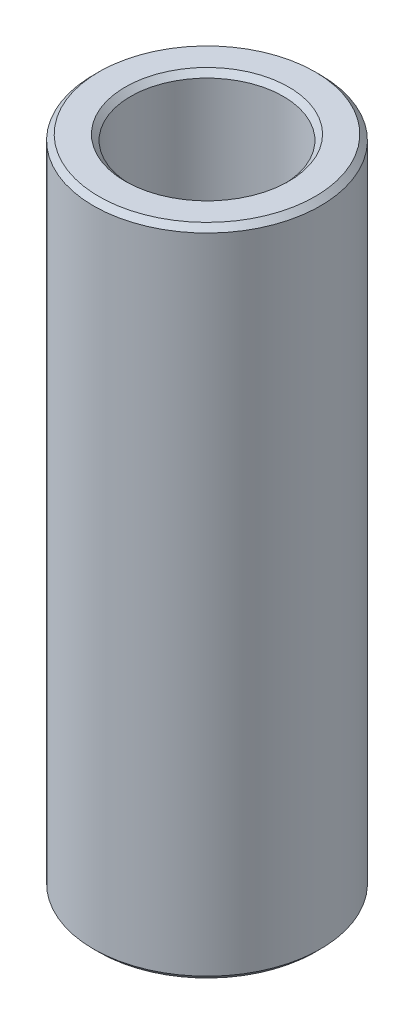
ISO-10303-21;
HEADER;
FILE_DESCRIPTION(('STEP AP214'),'2;1');
FILE_NAME('part.step','',(''),(''),'','','');
FILE_SCHEMA(('AUTOMOTIVE_DESIGN { 1 0 10303 214 1 1 1 1 }'));
ENDSEC;
DATA;
#1=APPLICATION_CONTEXT('core data for automotive mechanical design processes');
#2=APPLICATION_PROTOCOL_DEFINITION('international standard','automotive_design',2000,#1);
#3=PRODUCT_CONTEXT('',#1,'mechanical');
#4=PRODUCT('Part','Part','',(#3));
#5=PRODUCT_RELATED_PRODUCT_CATEGORY('part','',(#4));
#6=PRODUCT_DEFINITION_FORMATION('','',#4);
#7=PRODUCT_DEFINITION_CONTEXT('part definition',#1,'design');
#8=PRODUCT_DEFINITION('design','',#6,#7);
#9=PRODUCT_DEFINITION_SHAPE('','',#8);
#10=(LENGTH_UNIT() NAMED_UNIT(*) SI_UNIT(.MILLI.,.METRE.));
#11=(NAMED_UNIT(*) PLANE_ANGLE_UNIT() SI_UNIT($,.RADIAN.));
#12=(NAMED_UNIT(*) SI_UNIT($,.STERADIAN.) SOLID_ANGLE_UNIT());
#13=UNCERTAINTY_MEASURE_WITH_UNIT(LENGTH_MEASURE(1.E-05),#10,'distance_accuracy_value','');
#14=(GEOMETRIC_REPRESENTATION_CONTEXT(3) GLOBAL_UNCERTAINTY_ASSIGNED_CONTEXT((#13)) GLOBAL_UNIT_ASSIGNED_CONTEXT((#10,
#11,#12)) REPRESENTATION_CONTEXT('',''));
#15=CARTESIAN_POINT('',(0.,0.,0.));
#16=DIRECTION('',(0.,0.,1.));
#17=DIRECTION('',(1.,0.,0.));
#18=AXIS2_PLACEMENT_3D('',#15,#16,#17);
#19=CARTESIAN_POINT('',(0.,331.619112622185,0.));
#20=DIRECTION('',(0.,-1.,0.));
#21=DIRECTION('',(0.,0.,-1.));
#22=AXIS2_PLACEMENT_3D('',#19,#20,#21);
#23=CYLINDRICAL_SURFACE('',#22,57.5);
#24=CARTESIAN_POINT('',(0.,2.74004141183187,0.));
#25=DIRECTION('',(0.,1.,0.));
#26=DIRECTION('',(0.,0.,1.));
#27=AXIS2_PLACEMENT_3D('',#24,#25,#26);
#28=CIRCLE('',#27,57.5);
#29=CARTESIAN_POINT('',(0.,2.74004141183187,57.5));
#30=VERTEX_POINT('',#29);
#31=EDGE_CURVE('E10',#30,#30,#28,.T.);
#32=ORIENTED_EDGE('',*,*,#31,.T.);
#33=EDGE_LOOP('',(#32));
#34=FACE_BOUND('',#33,.T.);
#35=CARTESIAN_POINT('',(0.,328.879071210353,0.));
#36=DIRECTION('',(0.,1.,0.));
#37=DIRECTION('',(0.,0.,1.));
#38=AXIS2_PLACEMENT_3D('',#35,#36,#37);
#39=CIRCLE('',#38,57.5);
#40=CARTESIAN_POINT('',(0.,328.879071210353,-57.5));
#41=VERTEX_POINT('',#40);
#42=EDGE_CURVE('E50',#41,#41,#39,.F.);
#43=ORIENTED_EDGE('',*,*,#42,.T.);
#44=EDGE_LOOP('',(#43));
#45=FACE_BOUND('',#44,.T.);
#46=ADVANCED_FACE('F39',(#34,#45),#23,.T.);
#47=CARTESIAN_POINT('',(0.,331.619112622185,0.));
#48=DIRECTION('',(0.,1.,0.));
#49=DIRECTION('',(0.,0.,1.));
#50=AXIS2_PLACEMENT_3D('',#47,#48,#49);
#51=PLANE('',#50);
#52=CARTESIAN_POINT('',(0.,331.619112622185,0.));
#53=DIRECTION('',(0.,1.,0.));
#54=DIRECTION('',(0.,0.,1.));
#55=AXIS2_PLACEMENT_3D('',#52,#53,#54);
#56=CIRCLE('',#55,41.4231168577925);
#57=CARTESIAN_POINT('',(0.,331.619112622185,41.4231168577925));
#58=VERTEX_POINT('',#57);
#59=EDGE_CURVE('E58',#58,#58,#56,.F.);
#60=ORIENTED_EDGE('',*,*,#59,.T.);
#61=EDGE_LOOP('',(#60));
#62=FACE_BOUND('',#61,.T.);
#63=CARTESIAN_POINT('',(0.,331.619112622185,0.));
#64=DIRECTION('',(0.,1.,0.));
#65=DIRECTION('',(0.,0.,1.));
#66=AXIS2_PLACEMENT_3D('',#63,#64,#65);
#67=CIRCLE('',#66,54.7599585881681);
#68=CARTESIAN_POINT('',(0.,331.619112622185,-54.7599585881681));
#69=VERTEX_POINT('',#68);
#70=EDGE_CURVE('E61',#69,#69,#67,.T.);
#71=ORIENTED_EDGE('',*,*,#70,.T.);
#72=EDGE_LOOP('',(#71));
#73=FACE_BOUND('',#72,.T.);
#74=ADVANCED_FACE('F88',(#62,#73),#51,.T.);
#75=CARTESIAN_POINT('',(0.,0.,0.));
#76=DIRECTION('',(0.,1.,0.));
#77=DIRECTION('',(0.,0.,1.));
#78=AXIS2_PLACEMENT_3D('',#75,#76,#77);
#79=PLANE('',#78);
#80=CARTESIAN_POINT('',(0.,0.,0.));
#81=DIRECTION('',(0.,1.,0.));
#82=DIRECTION('',(0.,0.,1.));
#83=AXIS2_PLACEMENT_3D('',#80,#81,#82);
#84=CIRCLE('',#83,41.4231168577925);
#85=CARTESIAN_POINT('',(0.,0.,-41.4231168577925));
#86=VERTEX_POINT('',#85);
#87=EDGE_CURVE('E51',#86,#86,#84,.T.);
#88=ORIENTED_EDGE('',*,*,#87,.T.);
#89=EDGE_LOOP('',(#88));
#90=FACE_BOUND('',#89,.T.);
#91=CARTESIAN_POINT('',(0.,0.,0.));
#92=DIRECTION('',(0.,1.,0.));
#93=DIRECTION('',(0.,0.,1.));
#94=AXIS2_PLACEMENT_3D('',#91,#92,#93);
#95=CIRCLE('',#94,54.7599585881681);
#96=CARTESIAN_POINT('',(0.,0.,54.7599585881681));
#97=VERTEX_POINT('',#96);
#98=EDGE_CURVE('E54',#97,#97,#95,.F.);
#99=ORIENTED_EDGE('',*,*,#98,.T.);
#100=EDGE_LOOP('',(#99));
#101=FACE_BOUND('',#100,.T.);
#102=ADVANCED_FACE('F83',(#90,#101),#79,.F.);
#103=CARTESIAN_POINT('',(0.,331.619112622185,0.));
#104=DIRECTION('',(0.,-1.,0.));
#105=DIRECTION('',(0.,0.,-1.));
#106=AXIS2_PLACEMENT_3D('',#103,#104,#105);
#107=CYLINDRICAL_SURFACE('',#106,38.6830754459606);
#108=CARTESIAN_POINT('',(0.,328.879071210353,0.));
#109=DIRECTION('',(0.,1.,0.));
#110=DIRECTION('',(0.,0.,1.));
#111=AXIS2_PLACEMENT_3D('',#108,#109,#110);
#112=CIRCLE('',#111,38.6830754459606);
#113=CARTESIAN_POINT('',(0.,328.879071210353,-38.6830754459606));
#114=VERTEX_POINT('',#113);
#115=EDGE_CURVE('E67',#114,#114,#112,.T.);
#116=CARTESIAN_POINT('',(0.,2.74004141183198,0.));
#117=DIRECTION('',(0.,1.,0.));
#118=DIRECTION('',(0.,0.,1.));
#119=AXIS2_PLACEMENT_3D('',#116,#117,#118);
#120=CIRCLE('',#119,38.6830754459606);
#121=CARTESIAN_POINT('',(0.,2.74004141183198,-38.6830754459606));
#122=VERTEX_POINT('',#121);
#123=EDGE_CURVE('E69',#122,#122,#120,.F.);
#124=CARTESIAN_POINT('',(0.,328.879071210353,-38.6830754459606));
#125=CARTESIAN_POINT('',(0.,325.481789649952,-38.6830754459606));
#126=CARTESIAN_POINT('',(0.,322.08450808955,-38.6830754459606));
#127=CARTESIAN_POINT('',(0.,315.289944968748,-38.6830754459606));
#128=CARTESIAN_POINT('',(0.,311.892663408347,-38.6830754459606));
#129=CARTESIAN_POINT('',(0.,305.098100287544,-38.6830754459606));
#130=CARTESIAN_POINT('',(0.,301.700818727143,-38.6830754459606));
#131=CARTESIAN_POINT('',(0.,294.90625560634,-38.6830754459606));
#132=CARTESIAN_POINT('',(0.,291.508974045939,-38.6830754459606));
#133=CARTESIAN_POINT('',(0.,284.714410925137,-38.6830754459606));
#134=CARTESIAN_POINT('',(0.,281.317129364735,-38.6830754459606));
#135=CARTESIAN_POINT('',(0.,274.522566243933,-38.6830754459606));
#136=CARTESIAN_POINT('',(0.,271.125284683532,-38.6830754459606));
#137=CARTESIAN_POINT('',(0.,264.330721562729,-38.6830754459606));
#138=CARTESIAN_POINT('',(0.,260.933440002328,-38.6830754459606));
#139=CARTESIAN_POINT('',(0.,254.138876881525,-38.6830754459606));
#140=CARTESIAN_POINT('',(0.,250.741595321124,-38.6830754459606));
#141=CARTESIAN_POINT('',(0.,243.947032200321,-38.6830754459606));
#142=CARTESIAN_POINT('',(0.,240.54975063992,-38.6830754459606));
#143=CARTESIAN_POINT('',(0.,233.755187519118,-38.6830754459606));
#144=CARTESIAN_POINT('',(0.,230.357905958716,-38.6830754459606));
#145=CARTESIAN_POINT('',(0.,223.563342837914,-38.6830754459606));
#146=CARTESIAN_POINT('',(0.,220.166061277513,-38.6830754459606));
#147=CARTESIAN_POINT('',(0.,213.37149815671,-38.6830754459606));
#148=CARTESIAN_POINT('',(0.,209.974216596309,-38.6830754459606));
#149=CARTESIAN_POINT('',(0.,203.179653475506,-38.6830754459606));
#150=CARTESIAN_POINT('',(0.,199.782371915105,-38.6830754459606));
#151=CARTESIAN_POINT('',(0.,192.987808794303,-38.6830754459606));
#152=CARTESIAN_POINT('',(0.,189.590527233901,-38.6830754459606));
#153=CARTESIAN_POINT('',(0.,182.795964113099,-38.6830754459606));
#154=CARTESIAN_POINT('',(0.,179.398682552697,-38.6830754459606));
#155=CARTESIAN_POINT('',(0.,172.604119431895,-38.6830754459606));
#156=CARTESIAN_POINT('',(0.,169.206837871494,-38.6830754459606));
#157=CARTESIAN_POINT('',(0.,162.412274750691,-38.6830754459606));
#158=CARTESIAN_POINT('',(0.,159.01499319029,-38.6830754459606));
#159=CARTESIAN_POINT('',(0.,152.220430069487,-38.6830754459606));
#160=CARTESIAN_POINT('',(0.,148.823148509086,-38.6830754459606));
#161=CARTESIAN_POINT('',(0.,142.028585388284,-38.6830754459606));
#162=CARTESIAN_POINT('',(0.,138.631303827882,-38.6830754459606));
#163=CARTESIAN_POINT('',(0.,131.83674070708,-38.6830754459606));
#164=CARTESIAN_POINT('',(0.,128.439459146679,-38.6830754459606));
#165=CARTESIAN_POINT('',(0.,121.644896025876,-38.6830754459606));
#166=CARTESIAN_POINT('',(0.,118.247614465475,-38.6830754459606));
#167=CARTESIAN_POINT('',(0.,111.453051344672,-38.6830754459606));
#168=CARTESIAN_POINT('',(0.,108.055769784271,-38.6830754459606));
#169=CARTESIAN_POINT('',(0.,101.261206663468,-38.6830754459606));
#170=CARTESIAN_POINT('',(0.,97.8639251030672,-38.6830754459606));
#171=CARTESIAN_POINT('',(0.,91.0693619822647,-38.6830754459606));
#172=CARTESIAN_POINT('',(0.,87.6720804218634,-38.6830754459606));
#173=CARTESIAN_POINT('',(0.,80.8775173010609,-38.6830754459606));
#174=CARTESIAN_POINT('',(0.,77.4802357406597,-38.6830754459606));
#175=CARTESIAN_POINT('',(0.,70.6856726198572,-38.6830754459606));
#176=CARTESIAN_POINT('',(0.,67.2883910594559,-38.6830754459606));
#177=CARTESIAN_POINT('',(0.,60.4938279386534,-38.6830754459606));
#178=CARTESIAN_POINT('',(0.,57.0965463782521,-38.6830754459606));
#179=CARTESIAN_POINT('',(0.,50.3019832574496,-38.6830754459606));
#180=CARTESIAN_POINT('',(0.,46.9047016970483,-38.6830754459606));
#181=CARTESIAN_POINT('',(0.,40.1101385762458,-38.6830754459606));
#182=CARTESIAN_POINT('',(0.,36.7128570158446,-38.6830754459606));
#183=CARTESIAN_POINT('',(0.,29.9182938950421,-38.6830754459606));
#184=CARTESIAN_POINT('',(0.,26.5210123346408,-38.6830754459606));
#185=CARTESIAN_POINT('',(0.,19.7264492138382,-38.6830754459606));
#186=CARTESIAN_POINT('',(0.,16.329167653437,-38.6830754459606));
#187=CARTESIAN_POINT('',(0.,9.53460453263446,-38.6830754459606));
#188=CARTESIAN_POINT('',(0.,6.13732297223321,-38.6830754459606));
#189=CARTESIAN_POINT('',(0.,2.74004141183198,-38.6830754459606));
#190=B_SPLINE_CURVE_WITH_KNOTS('',3,(#124,#125,#126,#127,#128,#129,#130,#131,#132,#133,#134,
#135,#136,#137,#138,#139,#140,#141,#142,#143,#144,#145,#146,#147,#148,#149,#150,#151,#152,#153,
#154,#155,#156,#157,#158,#159,#160,#161,#162,#163,#164,#165,#166,#167,#168,#169,#170,#171,#172,
#173,#174,#175,#176,#177,#178,#179,#180,#181,#182,#183,#184,#185,#186,#187,#188,#189),
.UNSPECIFIED.,.F.,.F.,(4,2,2,2,2,2,2,2,2,2,2,2,2,2,2,2,2,2,2,2,2,2,2,2,2,2,2,2,2,2,2,2,4),(0.,
10.1918446812038,20.3836893624075,30.5755340436113,40.7673787248151,50.9592234060189,
61.1510680872226,71.3429127684264,81.5347574496302,91.726602130834,101.918446812038,
112.110291493242,122.302136174445,132.493980855649,142.685825536853,152.877670218057,
163.06951489926,173.261359580464,183.453204261668,193.645048942872,203.836893624076,
214.028738305279,224.220582986483,234.412427667687,244.604272348891,254.796117030094,
264.987961711298,275.179806392502,285.371651073706,295.56349575491,305.755340436113,
315.947185117317,326.139029798521),.UNSPECIFIED.);
#191=EDGE_CURVE('BSEAM71',#114,#122,#190,.T.);
#192=ORIENTED_EDGE('',*,*,#115,.T.);
#193=ORIENTED_EDGE('',*,*,#123,.T.);
#194=ORIENTED_EDGE('',*,*,#191,.T.);
#195=ORIENTED_EDGE('',*,*,#191,.F.);
#196=EDGE_LOOP('',(#192,#194,#193,#195));
#197=FACE_BOUND('',#196,.T.);
#198=ADVANCED_FACE('F71',(#197),#107,.F.);
#199=CARTESIAN_POINT('',(0.,328.879071210353,0.));
#200=DIRECTION('',(0.,1.,0.));
#201=DIRECTION('',(0.,0.,1.));
#202=AXIS2_PLACEMENT_3D('',#199,#200,#201);
#203=CONICAL_SURFACE('',#202,38.6830754459606,0.785398163397448);
#204=ORIENTED_EDGE('',*,*,#59,.F.);
#205=EDGE_LOOP('',(#204));
#206=FACE_BOUND('',#205,.T.);
#207=ORIENTED_EDGE('',*,*,#115,.F.);
#208=EDGE_LOOP('',(#207));
#209=FACE_BOUND('',#208,.T.);
#210=ADVANCED_FACE('F77',(#206,#209),#203,.F.);
#211=CARTESIAN_POINT('',(0.,0.,0.));
#212=DIRECTION('',(0.,-1.,0.));
#213=DIRECTION('',(0.,0.,-1.));
#214=AXIS2_PLACEMENT_3D('',#211,#212,#213);
#215=CONICAL_SURFACE('',#214,41.4231168577925,0.785398163397443);
#216=CARTESIAN_POINT('',(0.,2.74004141183198,-38.6830754459606));
#217=CARTESIAN_POINT('',(0.,2.71149931379207,-38.7116175440005));
#218=CARTESIAN_POINT('',(0.,2.68295721575215,-38.7401596420404));
#219=CARTESIAN_POINT('',(0.,2.62587301967232,-38.7972438381202));
#220=CARTESIAN_POINT('',(0.,2.5973309216324,-38.8257859361601));
#221=CARTESIAN_POINT('',(0.,2.54024672555257,-38.88287013224));
#222=CARTESIAN_POINT('',(0.,2.51170462751265,-38.9114122302799));
#223=CARTESIAN_POINT('',(0.,2.45462043143282,-38.9684964263597));
#224=CARTESIAN_POINT('',(0.,2.4260783333929,-38.9970385243996));
#225=CARTESIAN_POINT('',(0.,2.36899413731307,-39.0541227204795));
#226=CARTESIAN_POINT('',(0.,2.34045203927315,-39.0826648185194));
#227=CARTESIAN_POINT('',(0.,2.28336784319332,-39.1397490145992));
#228=CARTESIAN_POINT('',(0.,2.2548257451534,-39.1682911126391));
#229=CARTESIAN_POINT('',(0.,2.19774154907357,-39.225375308719));
#230=CARTESIAN_POINT('',(0.,2.16919945103365,-39.2539174067589));
#231=CARTESIAN_POINT('',(0.,2.11211525495382,-39.3110016028387));
#232=CARTESIAN_POINT('',(0.,2.0835731569139,-39.3395437008786));
#233=CARTESIAN_POINT('',(0.,2.02648896083407,-39.3966278969585));
#234=CARTESIAN_POINT('',(0.,1.99794686279415,-39.4251699949984));
#235=CARTESIAN_POINT('',(0.,1.94086266671432,-39.4822541910782));
#236=CARTESIAN_POINT('',(0.,1.91232056867441,-39.5107962891181));
#237=CARTESIAN_POINT('',(0.,1.85523637259457,-39.567880485198));
#238=CARTESIAN_POINT('',(0.,1.82669427455465,-39.5964225832379));
#239=CARTESIAN_POINT('',(0.,1.76961007847482,-39.6535067793177));
#240=CARTESIAN_POINT('',(0.,1.74106798043491,-39.6820488773576));
#241=CARTESIAN_POINT('',(0.,1.68398378435507,-39.7391330734375));
#242=CARTESIAN_POINT('',(0.,1.65544168631516,-39.7676751714774));
#243=CARTESIAN_POINT('',(0.,1.59835749023532,-39.8247593675572));
#244=CARTESIAN_POINT('',(0.,1.56981539219541,-39.8533014655971));
#245=CARTESIAN_POINT('',(0.,1.51273119611557,-39.910385661677));
#246=CARTESIAN_POINT('',(0.,1.48418909807566,-39.9389277597169));
#247=CARTESIAN_POINT('',(0.,1.42710490199582,-39.9960119557967));
#248=CARTESIAN_POINT('',(0.,1.39856280395591,-40.0245540538366));
#249=CARTESIAN_POINT('',(0.,1.34147860787608,-40.0816382499165));
#250=CARTESIAN_POINT('',(0.,1.31293650983616,-40.1101803479564));
#251=CARTESIAN_POINT('',(0.,1.25585231375633,-40.1672645440362));
#252=CARTESIAN_POINT('',(0.,1.22731021571641,-40.1958066420761));
#253=CARTESIAN_POINT('',(0.,1.17022601963658,-40.2528908381559));
#254=CARTESIAN_POINT('',(0.,1.14168392159666,-40.2814329361959));
#255=CARTESIAN_POINT('',(0.,1.08459972551683,-40.3385171322757));
#256=CARTESIAN_POINT('',(0.,1.05605762747691,-40.3670592303156));
#257=CARTESIAN_POINT('',(0.,0.998973431397077,-40.4241434263954));
#258=CARTESIAN_POINT('',(0.,0.970431333357161,-40.4526855244354));
#259=CARTESIAN_POINT('',(0.,0.913347137277329,-40.5097697205152));
#260=CARTESIAN_POINT('',(0.,0.884805039237411,-40.5383118185551));
#261=CARTESIAN_POINT('',(0.,0.827720843157578,-40.5953960146349));
#262=CARTESIAN_POINT('',(0.,0.799178745117662,-40.6239381126749));
#263=CARTESIAN_POINT('',(0.,0.742094549037829,-40.6810223087547));
#264=CARTESIAN_POINT('',(0.,0.713552450997912,-40.7095644067946));
#265=CARTESIAN_POINT('',(0.,0.656468254918079,-40.7666486028744));
#266=CARTESIAN_POINT('',(0.,0.627926156878163,-40.7951907009144));
#267=CARTESIAN_POINT('',(0.,0.57084196079833,-40.8522748969942));
#268=CARTESIAN_POINT('',(0.,0.542299862758414,-40.8808169950341));
#269=CARTESIAN_POINT('',(0.,0.48521566667858,-40.9379011911139));
#270=CARTESIAN_POINT('',(0.,0.456673568638663,-40.9664432891539));
#271=CARTESIAN_POINT('',(0.,0.399589372558831,-41.0235274852337));
#272=CARTESIAN_POINT('',(0.,0.371047274518915,-41.0520695832736));
#273=CARTESIAN_POINT('',(0.,0.313963078439082,-41.1091537793534));
#274=CARTESIAN_POINT('',(0.,0.285420980399165,-41.1376958773934));
#275=CARTESIAN_POINT('',(0.,0.228336784319332,-41.1947800734732));
#276=CARTESIAN_POINT('',(0.,0.199794686279415,-41.2233221715131));
#277=CARTESIAN_POINT('',(0.,0.142710490199583,-41.2804063675929));
#278=CARTESIAN_POINT('',(0.,0.114168392159666,-41.3089484656329));
#279=CARTESIAN_POINT('',(0.,0.0570841960798329,-41.3660326617127));
#280=CARTESIAN_POINT('',(0.,0.0285420980399164,-41.3945747597526));
#281=CARTESIAN_POINT('',(0.,0.,-41.4231168577925));
#282=B_SPLINE_CURVE_WITH_KNOTS('',3,(#216,#217,#218,#219,#220,#221,#222,#223,#224,#225,#226,
#227,#228,#229,#230,#231,#232,#233,#234,#235,#236,#237,#238,#239,#240,#241,#242,#243,#244,#245,
#246,#247,#248,#249,#250,#251,#252,#253,#254,#255,#256,#257,#258,#259,#260,#261,#262,#263,#264,
#265,#266,#267,#268,#269,#270,#271,#272,#273,#274,#275,#276,#277,#278,#279,#280,#281),
.UNSPECIFIED.,.F.,.F.,(4,2,2,2,2,2,2,2,2,2,2,2,2,2,2,2,2,2,2,2,2,2,2,2,2,2,2,2,2,2,2,2,4),(0.,
0.121093866439896,0.242187732879792,0.363281599319688,0.484375465759584,0.605469332199485,
0.726563198639381,0.847657065079278,0.968750931519174,1.08984479795907,1.21093866439897,
1.33203253083886,1.45312639727876,1.57422026371866,1.69531413015856,1.81640799659845,
1.93750186303835,2.05859572947824,2.17968959591814,2.30078346235804,2.42187732879793,
2.54297119523783,2.66406506167773,2.78515892811762,2.90625279455752,3.02734666099742,
3.14844052743731,3.26953439387721,3.39062826031711,3.51172212675701,3.6328159931969,
3.7539098596368,3.87500372607669),.UNSPECIFIED.);
#283=EDGE_CURVE('BSEAM73',#122,#86,#282,.T.);
#284=ORIENTED_EDGE('',*,*,#123,.F.);
#285=ORIENTED_EDGE('',*,*,#87,.F.);
#286=ORIENTED_EDGE('',*,*,#283,.T.);
#287=ORIENTED_EDGE('',*,*,#283,.F.);
#288=EDGE_LOOP('',(#284,#286,#285,#287));
#289=FACE_BOUND('',#288,.T.);
#290=ADVANCED_FACE('F73',(#289),#215,.F.);
#291=CARTESIAN_POINT('',(0.,2.74004141183187,0.));
#292=DIRECTION('',(0.,1.,0.));
#293=DIRECTION('',(0.,0.,1.));
#294=AXIS2_PLACEMENT_3D('',#291,#292,#293);
#295=CONICAL_SURFACE('',#294,57.5,0.785398163397458);
#296=ORIENTED_EDGE('',*,*,#98,.F.);
#297=EDGE_LOOP('',(#296));
#298=FACE_BOUND('',#297,.T.);
#299=ORIENTED_EDGE('',*,*,#31,.F.);
#300=EDGE_LOOP('',(#299));
#301=FACE_BOUND('',#300,.T.);
#302=ADVANCED_FACE('F76',(#298,#301),#295,.T.);
#303=CARTESIAN_POINT('',(0.,331.619112622185,0.));
#304=DIRECTION('',(0.,-1.,0.));
#305=DIRECTION('',(0.,0.,-1.));
#306=AXIS2_PLACEMENT_3D('',#303,#304,#305);
#307=CONICAL_SURFACE('',#306,54.7599585881681,0.78539816339745);
#308=CARTESIAN_POINT('',(0.,328.879071210353,-57.5));
#309=CARTESIAN_POINT('',(0.,328.907613308393,-57.4714579019601));
#310=CARTESIAN_POINT('',(0.,328.936155406433,-57.4429158039202));
#311=CARTESIAN_POINT('',(0.,328.993239602513,-57.3858316078404));
#312=CARTESIAN_POINT('',(0.,329.021781700552,-57.3572895098005));
#313=CARTESIAN_POINT('',(0.,329.078865896632,-57.3002053137206));
#314=CARTESIAN_POINT('',(0.,329.107407994672,-57.2716632156807));
#315=CARTESIAN_POINT('',(0.,329.164492190752,-57.2145790196009));
#316=CARTESIAN_POINT('',(0.,329.193034288792,-57.186036921561));
#317=CARTESIAN_POINT('',(0.,329.250118484872,-57.1289527254811));
#318=CARTESIAN_POINT('',(0.,329.278660582912,-57.1004106274412));
#319=CARTESIAN_POINT('',(0.,329.335744778992,-57.0433264313614));
#320=CARTESIAN_POINT('',(0.,329.364286877031,-57.0147843333215));
#321=CARTESIAN_POINT('',(0.,329.421371073111,-56.9577001372416));
#322=CARTESIAN_POINT('',(0.,329.449913171151,-56.9291580392017));
#323=CARTESIAN_POINT('',(0.,329.506997367231,-56.8720738431219));
#324=CARTESIAN_POINT('',(0.,329.535539465271,-56.843531745082));
#325=CARTESIAN_POINT('',(0.,329.592623661351,-56.7864475490021));
#326=CARTESIAN_POINT('',(0.,329.621165759391,-56.7579054509622));
#327=CARTESIAN_POINT('',(0.,329.678249955471,-56.7008212548824));
#328=CARTESIAN_POINT('',(0.,329.70679205351,-56.6722791568425));
#329=CARTESIAN_POINT('',(0.,329.76387624959,-56.6151949607626));
#330=CARTESIAN_POINT('',(0.,329.79241834763,-56.5866528627227));
#331=CARTESIAN_POINT('',(0.,329.84950254371,-56.5295686666429));
#332=CARTESIAN_POINT('',(0.,329.87804464175,-56.501026568603));
#333=CARTESIAN_POINT('',(0.,329.93512883783,-56.4439423725231));
#334=CARTESIAN_POINT('',(0.,329.96367093587,-56.4154002744832));
#335=CARTESIAN_POINT('',(0.,330.02075513195,-56.3583160784034));
#336=CARTESIAN_POINT('',(0.,330.049297229989,-56.3297739803635));
#337=CARTESIAN_POINT('',(0.,330.106381426069,-56.2726897842836));
#338=CARTESIAN_POINT('',(0.,330.134923524109,-56.2441476862437));
#339=CARTESIAN_POINT('',(0.,330.192007720189,-56.1870634901639));
#340=CARTESIAN_POINT('',(0.,330.220549818229,-56.158521392124));
#341=CARTESIAN_POINT('',(0.,330.277634014309,-56.1014371960442));
#342=CARTESIAN_POINT('',(0.,330.306176112349,-56.0728950980042));
#343=CARTESIAN_POINT('',(0.,330.363260308429,-56.0158109019244));
#344=CARTESIAN_POINT('',(0.,330.391802406468,-55.9872688038845));
#345=CARTESIAN_POINT('',(0.,330.448886602548,-55.9301846078046));
#346=CARTESIAN_POINT('',(0.,330.477428700588,-55.9016425097647));
#347=CARTESIAN_POINT('',(0.,330.534512896668,-55.8445583136849));
#348=CARTESIAN_POINT('',(0.,330.563054994708,-55.816016215645));
#349=CARTESIAN_POINT('',(0.,330.620139190788,-55.7589320195652));
#350=CARTESIAN_POINT('',(0.,330.648681288828,-55.7303899215252));
#351=CARTESIAN_POINT('',(0.,330.705765484908,-55.6733057254454));
#352=CARTESIAN_POINT('',(0.,330.734307582947,-55.6447636274055));
#353=CARTESIAN_POINT('',(0.,330.791391779027,-55.5876794313257));
#354=CARTESIAN_POINT('',(0.,330.819933877067,-55.5591373332857));
#355=CARTESIAN_POINT('',(0.,330.877018073147,-55.5020531372059));
#356=CARTESIAN_POINT('',(0.,330.905560171187,-55.473511039166));
#357=CARTESIAN_POINT('',(0.,330.962644367267,-55.4164268430862));
#358=CARTESIAN_POINT('',(0.,330.991186465307,-55.3878847450462));
#359=CARTESIAN_POINT('',(0.,331.048270661387,-55.3308005489664));
#360=CARTESIAN_POINT('',(0.,331.076812759426,-55.3022584509265));
#361=CARTESIAN_POINT('',(0.,331.133896955506,-55.2451742548467));
#362=CARTESIAN_POINT('',(0.,331.162439053546,-55.2166321568067));
#363=CARTESIAN_POINT('',(0.,331.219523249626,-55.1595479607269));
#364=CARTESIAN_POINT('',(0.,331.248065347666,-55.131005862687));
#365=CARTESIAN_POINT('',(0.,331.305149543746,-55.0739216666072));
#366=CARTESIAN_POINT('',(0.,331.333691641786,-55.0453795685673));
#367=CARTESIAN_POINT('',(0.,331.390775837866,-54.9882953724874));
#368=CARTESIAN_POINT('',(0.,331.419317935905,-54.9597532744475));
#369=CARTESIAN_POINT('',(0.,331.476402131985,-54.9026690783677));
#370=CARTESIAN_POINT('',(0.,331.504944230025,-54.8741269803278));
#371=CARTESIAN_POINT('',(0.,331.562028426105,-54.8170427842479));
#372=CARTESIAN_POINT('',(0.,331.590570524145,-54.788500686208));
#373=CARTESIAN_POINT('',(0.,331.619112622185,-54.7599585881681));
#374=B_SPLINE_CURVE_WITH_KNOTS('',3,(#308,#309,#310,#311,#312,#313,#314,#315,#316,#317,#318,
#319,#320,#321,#322,#323,#324,#325,#326,#327,#328,#329,#330,#331,#332,#333,#334,#335,#336,#337,
#338,#339,#340,#341,#342,#343,#344,#345,#346,#347,#348,#349,#350,#351,#352,#353,#354,#355,#356,
#357,#358,#359,#360,#361,#362,#363,#364,#365,#366,#367,#368,#369,#370,#371,#372,#373),
.UNSPECIFIED.,.F.,.F.,(4,2,2,2,2,2,2,2,2,2,2,2,2,2,2,2,2,2,2,2,2,2,2,2,2,2,2,2,2,2,2,2,4),(0.,
0.121093866439885,0.24218773287977,0.363281599319655,0.48437546575958,0.605469332199465,
0.72656319863935,0.847657065079235,0.968750931519159,1.08984479795904,1.21093866439893,
1.33203253083881,1.45312639727874,1.57422026371862,1.69531413015851,1.8164079965984,
1.93750186303832,2.05859572947821,2.17968959591809,2.30078346235798,2.4218773287979,
2.54297119523779,2.66406506167767,2.78515892811756,2.90625279455748,3.02734666099737,
3.14844052743725,3.26953439387714,3.39062826031706,3.51172212675695,3.63281599319683,
3.75390985963672,3.87500372607664),.UNSPECIFIED.);
#375=EDGE_CURVE('BSEAM45',#41,#69,#374,.T.);
#376=ORIENTED_EDGE('',*,*,#42,.F.);
#377=ORIENTED_EDGE('',*,*,#70,.F.);
#378=ORIENTED_EDGE('',*,*,#375,.T.);
#379=ORIENTED_EDGE('',*,*,#375,.F.);
#380=EDGE_LOOP('',(#376,#378,#377,#379));
#381=FACE_BOUND('',#380,.T.);
#382=ADVANCED_FACE('F45',(#381),#307,.T.);
#383=CLOSED_SHELL('',(#46,#74,#102,#198,#210,#290,#302,#382));
#384=MANIFOLD_SOLID_BREP('B2',#383);
#385=ADVANCED_BREP_SHAPE_REPRESENTATION('',(#18,#384),#14);
#386=SHAPE_DEFINITION_REPRESENTATION(#9,#385);
ENDSEC;
END-ISO-10303-21;
